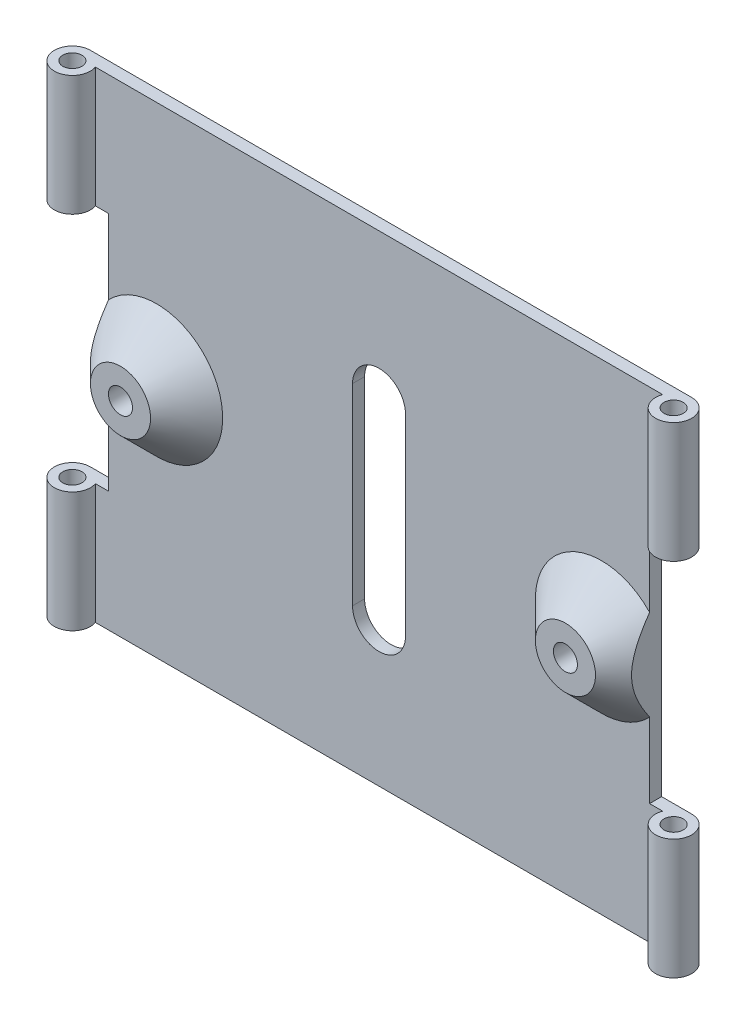
ISO-10303-21;
HEADER;
FILE_DESCRIPTION(('STEP AP214'),'2;1');
FILE_NAME('part.step','',(''),(''),'','','');
FILE_SCHEMA(('AUTOMOTIVE_DESIGN { 1 0 10303 214 1 1 1 1 }'));
ENDSEC;
DATA;
#1=APPLICATION_CONTEXT('core data for automotive mechanical design processes');
#2=APPLICATION_PROTOCOL_DEFINITION('international standard','automotive_design',2000,#1);
#3=PRODUCT_CONTEXT('',#1,'mechanical');
#4=PRODUCT('Part','Part','',(#3));
#5=PRODUCT_RELATED_PRODUCT_CATEGORY('part','',(#4));
#6=PRODUCT_DEFINITION_FORMATION('','',#4);
#7=PRODUCT_DEFINITION_CONTEXT('part definition',#1,'design');
#8=PRODUCT_DEFINITION('design','',#6,#7);
#9=PRODUCT_DEFINITION_SHAPE('','',#8);
#10=(LENGTH_UNIT() NAMED_UNIT(*) SI_UNIT(.MILLI.,.METRE.));
#11=(NAMED_UNIT(*) PLANE_ANGLE_UNIT() SI_UNIT($,.RADIAN.));
#12=(NAMED_UNIT(*) SI_UNIT($,.STERADIAN.) SOLID_ANGLE_UNIT());
#13=UNCERTAINTY_MEASURE_WITH_UNIT(LENGTH_MEASURE(1.E-05),#10,'distance_accuracy_value','');
#14=(GEOMETRIC_REPRESENTATION_CONTEXT(3) GLOBAL_UNCERTAINTY_ASSIGNED_CONTEXT((#13)) GLOBAL_UNIT_ASSIGNED_CONTEXT((#10,
#11,#12)) REPRESENTATION_CONTEXT('',''));
#15=CARTESIAN_POINT('',(0.,0.,0.));
#16=DIRECTION('',(0.,0.,1.));
#17=DIRECTION('',(1.,0.,0.));
#18=AXIS2_PLACEMENT_3D('',#15,#16,#17);
#19=CARTESIAN_POINT('',(25.,-24.2426406871193,1.5));
#20=DIRECTION('',(0.,1.,0.));
#21=DIRECTION('',(0.,0.,1.));
#22=AXIS2_PLACEMENT_3D('',#19,#20,#21);
#23=CYLINDRICAL_SURFACE('',#22,1.5);
#24=DIRECTION('',(0.,1.,0.));
#25=VECTOR('',#24,1.);
#26=CARTESIAN_POINT('',(23.5857864376269,-24.2426406871193,1.));
#27=LINE('',#26,#25);
#28=CARTESIAN_POINT('',(23.5857864376269,10.,1.));
#29=VERTEX_POINT('',#28);
#30=CARTESIAN_POINT('',(23.5857864376269,20.,1.));
#31=VERTEX_POINT('',#30);
#32=EDGE_CURVE('E254',#29,#31,#27,.T.);
#33=ORIENTED_EDGE('',*,*,#32,.F.);
#34=CARTESIAN_POINT('',(25.,10.,1.5));
#35=DIRECTION('',(0.,1.,0.));
#36=DIRECTION('',(0.,0.,1.));
#37=AXIS2_PLACEMENT_3D('',#34,#35,#36);
#38=CIRCLE('',#37,1.5);
#39=CARTESIAN_POINT('',(25.,10.,0.));
#40=VERTEX_POINT('',#39);
#41=EDGE_CURVE('E199',#40,#29,#38,.F.);
#42=ORIENTED_EDGE('',*,*,#41,.F.);
#43=DIRECTION('',(0.,1.,0.));
#44=VECTOR('',#43,1.);
#45=CARTESIAN_POINT('',(25.,-20.,0.));
#46=LINE('',#45,#44);
#47=CARTESIAN_POINT('',(25.,20.,0.));
#48=VERTEX_POINT('',#47);
#49=EDGE_CURVE('E299',#40,#48,#46,.T.);
#50=ORIENTED_EDGE('',*,*,#49,.T.);
#51=CARTESIAN_POINT('',(25.,20.,1.5));
#52=DIRECTION('',(0.,1.,0.));
#53=DIRECTION('',(0.,0.,1.));
#54=AXIS2_PLACEMENT_3D('',#51,#52,#53);
#55=CIRCLE('',#54,1.5);
#56=EDGE_CURVE('E246',#31,#48,#55,.T.);
#57=ORIENTED_EDGE('',*,*,#56,.F.);
#58=EDGE_LOOP('',(#33,#42,#50,#57));
#59=FACE_BOUND('',#58,.T.);
#60=ADVANCED_FACE('F33',(#59),#23,.T.);
#61=CARTESIAN_POINT('',(25.,-20.,1.5));
#62=DIRECTION('',(0.,1.,0.));
#63=DIRECTION('',(0.,0.,1.));
#64=AXIS2_PLACEMENT_3D('',#61,#62,#63);
#65=CYLINDRICAL_SURFACE('',#64,0.799999999999999);
#66=CARTESIAN_POINT('',(25.,10.,1.5));
#67=DIRECTION('',(0.,1.,0.));
#68=DIRECTION('',(0.,0.,1.));
#69=AXIS2_PLACEMENT_3D('',#66,#67,#68);
#70=CIRCLE('',#69,0.799999999999999);
#71=CARTESIAN_POINT('',(25.,10.,2.3));
#72=VERTEX_POINT('',#71);
#73=EDGE_CURVE('E198',#72,#72,#70,.F.);
#74=ORIENTED_EDGE('',*,*,#73,.T.);
#75=EDGE_LOOP('',(#74));
#76=FACE_BOUND('',#75,.T.);
#77=CARTESIAN_POINT('',(25.,20.,1.5));
#78=DIRECTION('',(0.,1.,0.));
#79=DIRECTION('',(0.,0.,1.));
#80=AXIS2_PLACEMENT_3D('',#77,#78,#79);
#81=CIRCLE('',#80,0.799999999999999);
#82=CARTESIAN_POINT('',(25.,20.,2.3));
#83=VERTEX_POINT('',#82);
#84=EDGE_CURVE('E236',#83,#83,#81,.T.);
#85=ORIENTED_EDGE('',*,*,#84,.T.);
#86=EDGE_LOOP('',(#85));
#87=FACE_BOUND('',#86,.T.);
#88=ADVANCED_FACE('F390',(#76,#87),#65,.F.);
#89=CARTESIAN_POINT('',(-25.,-24.2426406871193,1.5));
#90=DIRECTION('',(0.,1.,0.));
#91=DIRECTION('',(0.,0.,1.));
#92=AXIS2_PLACEMENT_3D('',#89,#90,#91);
#93=CYLINDRICAL_SURFACE('',#92,1.5);
#94=CARTESIAN_POINT('',(-25.,9.99999999999999,1.5));
#95=DIRECTION('',(0.,1.,0.));
#96=DIRECTION('',(-1.,0.,0.));
#97=AXIS2_PLACEMENT_3D('',#94,#95,#96);
#98=CIRCLE('',#97,1.5);
#99=CARTESIAN_POINT('',(-23.5857864376269,9.99999999999999,1.));
#100=VERTEX_POINT('',#99);
#101=CARTESIAN_POINT('',(-25.,10.,0.));
#102=VERTEX_POINT('',#101);
#103=EDGE_CURVE('E222',#100,#102,#98,.F.);
#104=ORIENTED_EDGE('',*,*,#103,.F.);
#105=DIRECTION('',(0.,1.,0.));
#106=VECTOR('',#105,1.);
#107=CARTESIAN_POINT('',(-23.5857864376269,-24.2426406871193,1.));
#108=LINE('',#107,#106);
#109=CARTESIAN_POINT('',(-23.5857864376269,20.,1.));
#110=VERTEX_POINT('',#109);
#111=EDGE_CURVE('E265',#110,#100,#108,.F.);
#112=ORIENTED_EDGE('',*,*,#111,.F.);
#113=CARTESIAN_POINT('',(-25.,20.,1.5));
#114=DIRECTION('',(0.,1.,0.));
#115=DIRECTION('',(0.,0.,1.));
#116=AXIS2_PLACEMENT_3D('',#113,#114,#115);
#117=CIRCLE('',#116,1.5);
#118=CARTESIAN_POINT('',(-25.,20.,0.));
#119=VERTEX_POINT('',#118);
#120=EDGE_CURVE('E258',#119,#110,#117,.T.);
#121=ORIENTED_EDGE('',*,*,#120,.F.);
#122=DIRECTION('',(0.,-1.,0.));
#123=VECTOR('',#122,1.);
#124=CARTESIAN_POINT('',(-25.,-20.,0.));
#125=LINE('',#124,#123);
#126=EDGE_CURVE('E312',#119,#102,#125,.T.);
#127=ORIENTED_EDGE('',*,*,#126,.T.);
#128=EDGE_LOOP('',(#104,#112,#121,#127));
#129=FACE_BOUND('',#128,.T.);
#130=ADVANCED_FACE('F378',(#129),#93,.T.);
#131=CARTESIAN_POINT('',(-25.,-20.,1.5));
#132=DIRECTION('',(0.,1.,0.));
#133=DIRECTION('',(0.,0.,1.));
#134=AXIS2_PLACEMENT_3D('',#131,#132,#133);
#135=CYLINDRICAL_SURFACE('',#134,0.799999999999999);
#136=CARTESIAN_POINT('',(-25.,-10.,1.5));
#137=DIRECTION('',(0.,-1.,0.));
#138=DIRECTION('',(1.,0.,0.));
#139=AXIS2_PLACEMENT_3D('',#136,#137,#138);
#140=CIRCLE('',#139,0.799999999999999);
#141=CARTESIAN_POINT('',(-24.2,-10.,1.5));
#142=VERTEX_POINT('',#141);
#143=EDGE_CURVE('E227',#142,#142,#140,.F.);
#144=ORIENTED_EDGE('',*,*,#143,.T.);
#145=EDGE_LOOP('',(#144));
#146=FACE_BOUND('',#145,.T.);
#147=CARTESIAN_POINT('',(-25.,-20.,1.5));
#148=DIRECTION('',(0.,1.,0.));
#149=DIRECTION('',(0.,0.,1.));
#150=AXIS2_PLACEMENT_3D('',#147,#148,#149);
#151=CIRCLE('',#150,0.799999999999999);
#152=CARTESIAN_POINT('',(-25.,-20.,2.3));
#153=VERTEX_POINT('',#152);
#154=EDGE_CURVE('E243',#153,#153,#151,.T.);
#155=ORIENTED_EDGE('',*,*,#154,.F.);
#156=EDGE_LOOP('',(#155));
#157=FACE_BOUND('',#156,.T.);
#158=ADVANCED_FACE('F355',(#146,#157),#135,.F.);
#159=CARTESIAN_POINT('',(0.,0.,1.));
#160=DIRECTION('',(0.,0.,-1.));
#161=DIRECTION('',(-1.,0.,0.));
#162=AXIS2_PLACEMENT_3D('',#159,#160,#161);
#163=PLANE('',#162);
#164=DIRECTION('',(0.,1.,0.));
#165=VECTOR('',#164,1.);
#166=CARTESIAN_POINT('',(22.5,0.,1.));
#167=LINE('',#166,#165);
#168=CARTESIAN_POINT('',(22.5,-10.,1.));
#169=VERTEX_POINT('',#168);
#170=CARTESIAN_POINT('',(22.5,-3.77491721763541,1.));
#171=VERTEX_POINT('',#170);
#172=EDGE_CURVE('E168',#169,#171,#167,.T.);
#173=ORIENTED_EDGE('',*,*,#172,.T.);
#174=CARTESIAN_POINT('',(18.5,0.,1.));
#175=DIRECTION('',(0.,0.,-1.));
#176=DIRECTION('',(-1.,0.,0.));
#177=AXIS2_PLACEMENT_3D('',#174,#175,#176);
#178=CIRCLE('',#177,5.50000000000002);
#179=CARTESIAN_POINT('',(22.5,3.77491721763541,1.));
#180=VERTEX_POINT('',#179);
#181=EDGE_CURVE('E326',#171,#180,#178,.T.);
#182=ORIENTED_EDGE('',*,*,#181,.T.);
#183=CARTESIAN_POINT('',(22.5,10.,1.));
#184=VERTEX_POINT('',#183);
#185=EDGE_CURVE('E204',#180,#184,#167,.T.);
#186=ORIENTED_EDGE('',*,*,#185,.T.);
#187=DIRECTION('',(1.,0.,0.));
#188=VECTOR('',#187,1.);
#189=CARTESIAN_POINT('',(0.,10.,1.));
#190=LINE('',#189,#188);
#191=EDGE_CURVE('E201',#184,#29,#190,.T.);
#192=ORIENTED_EDGE('',*,*,#191,.T.);
#193=ORIENTED_EDGE('',*,*,#32,.T.);
#194=DIRECTION('',(-1.,0.,0.));
#195=VECTOR('',#194,1.);
#196=CARTESIAN_POINT('',(-25.,20.,1.));
#197=LINE('',#196,#195);
#198=EDGE_CURVE('E300',#31,#110,#197,.T.);
#199=ORIENTED_EDGE('',*,*,#198,.T.);
#200=ORIENTED_EDGE('',*,*,#111,.T.);
#201=DIRECTION('',(1.,0.,0.));
#202=VECTOR('',#201,1.);
#203=CARTESIAN_POINT('',(0.,10.,1.));
#204=LINE('',#203,#202);
#205=CARTESIAN_POINT('',(-22.5,10.,1.));
#206=VERTEX_POINT('',#205);
#207=EDGE_CURVE('E224',#100,#206,#204,.T.);
#208=ORIENTED_EDGE('',*,*,#207,.T.);
#209=DIRECTION('',(0.,-1.,0.));
#210=VECTOR('',#209,1.);
#211=CARTESIAN_POINT('',(-22.5,0.,1.));
#212=LINE('',#211,#210);
#213=CARTESIAN_POINT('',(-22.5,3.77491721763535,1.));
#214=VERTEX_POINT('',#213);
#215=EDGE_CURVE('E234',#206,#214,#212,.T.);
#216=ORIENTED_EDGE('',*,*,#215,.T.);
#217=CARTESIAN_POINT('',(-18.5,0.,1.));
#218=DIRECTION('',(0.,0.,-1.));
#219=DIRECTION('',(-1.,0.,0.));
#220=AXIS2_PLACEMENT_3D('',#217,#218,#219);
#221=CIRCLE('',#220,5.49999999999999);
#222=CARTESIAN_POINT('',(-22.5,-3.77491721763535,1.));
#223=VERTEX_POINT('',#222);
#224=EDGE_CURVE('E305',#214,#223,#221,.T.);
#225=ORIENTED_EDGE('',*,*,#224,.T.);
#226=CARTESIAN_POINT('',(-22.5,-10.,1.));
#227=VERTEX_POINT('',#226);
#228=EDGE_CURVE('E233',#223,#227,#212,.T.);
#229=ORIENTED_EDGE('',*,*,#228,.T.);
#230=DIRECTION('',(-1.,0.,0.));
#231=VECTOR('',#230,1.);
#232=CARTESIAN_POINT('',(0.,-10.,1.));
#233=LINE('',#232,#231);
#234=CARTESIAN_POINT('',(-23.5857864376269,-10.,1.));
#235=VERTEX_POINT('',#234);
#236=EDGE_CURVE('E230',#227,#235,#233,.T.);
#237=ORIENTED_EDGE('',*,*,#236,.T.);
#238=CARTESIAN_POINT('',(-23.5857864376269,-20.,1.));
#239=VERTEX_POINT('',#238);
#240=EDGE_CURVE('E264',#235,#239,#108,.F.);
#241=ORIENTED_EDGE('',*,*,#240,.T.);
#242=DIRECTION('',(1.,0.,0.));
#243=VECTOR('',#242,1.);
#244=CARTESIAN_POINT('',(-25.,-20.,1.));
#245=LINE('',#244,#243);
#246=CARTESIAN_POINT('',(23.5857864376269,-20.,1.));
#247=VERTEX_POINT('',#246);
#248=EDGE_CURVE('E302',#239,#247,#245,.T.);
#249=ORIENTED_EDGE('',*,*,#248,.T.);
#250=CARTESIAN_POINT('',(23.5857864376269,-10.,1.));
#251=VERTEX_POINT('',#250);
#252=EDGE_CURVE('E255',#247,#251,#27,.T.);
#253=ORIENTED_EDGE('',*,*,#252,.T.);
#254=DIRECTION('',(-1.,0.,0.));
#255=VECTOR('',#254,1.);
#256=CARTESIAN_POINT('',(0.,-10.,1.));
#257=LINE('',#256,#255);
#258=EDGE_CURVE('E196',#251,#169,#257,.T.);
#259=ORIENTED_EDGE('',*,*,#258,.T.);
#260=EDGE_LOOP('',(#173,#182,#186,#192,#193,#199,#200,#208,#216,#225,#229,#237,#241,#249,#253,#259));
#261=FACE_BOUND('',#260,.T.);
#262=CARTESIAN_POINT('',(0.,7.8985132931506,1.));
#263=DIRECTION('',(0.,0.,1.));
#264=DIRECTION('',(1.,0.,0.));
#265=AXIS2_PLACEMENT_3D('',#262,#263,#264);
#266=CIRCLE('',#265,2.2);
#267=CARTESIAN_POINT('',(2.19999999999999,7.89851329315059,1.));
#268=VERTEX_POINT('',#267);
#269=CARTESIAN_POINT('',(-2.20000000000001,7.89851329315059,1.));
#270=VERTEX_POINT('',#269);
#271=EDGE_CURVE('E269',#268,#270,#266,.T.);
#272=ORIENTED_EDGE('',*,*,#271,.F.);
#273=DIRECTION('',(0.,1.,0.));
#274=VECTOR('',#273,1.);
#275=CARTESIAN_POINT('',(2.19999999999999,7.89851329315059,1.));
#276=LINE('',#275,#274);
#277=CARTESIAN_POINT('',(2.19999999999999,-8.10148670684941,1.));
#278=VERTEX_POINT('',#277);
#279=EDGE_CURVE('E277',#278,#268,#276,.T.);
#280=ORIENTED_EDGE('',*,*,#279,.F.);
#281=CARTESIAN_POINT('',(0.,-8.1014867068494,1.));
#282=DIRECTION('',(0.,0.,1.));
#283=DIRECTION('',(1.,0.,0.));
#284=AXIS2_PLACEMENT_3D('',#281,#282,#283);
#285=CIRCLE('',#284,2.2);
#286=CARTESIAN_POINT('',(-2.2,-8.1014867068494,1.));
#287=VERTEX_POINT('',#286);
#288=EDGE_CURVE('E274',#287,#278,#285,.T.);
#289=ORIENTED_EDGE('',*,*,#288,.F.);
#290=DIRECTION('',(0.,-1.,0.));
#291=VECTOR('',#290,1.);
#292=CARTESIAN_POINT('',(-2.20000000000001,7.89851329315059,1.));
#293=LINE('',#292,#291);
#294=EDGE_CURVE('E271',#270,#287,#293,.T.);
#295=ORIENTED_EDGE('',*,*,#294,.F.);
#296=EDGE_LOOP('',(#272,#280,#289,#295));
#297=FACE_BOUND('',#296,.T.);
#298=ADVANCED_FACE('F352',(#261,#297),#163,.F.);
#299=CARTESIAN_POINT('',(0.,0.,0.));
#300=DIRECTION('',(0.,0.,-1.));
#301=DIRECTION('',(-1.,0.,0.));
#302=AXIS2_PLACEMENT_3D('',#299,#300,#301);
#303=PLANE('',#302);
#304=DIRECTION('',(-1.,0.,0.));
#305=VECTOR('',#304,1.);
#306=CARTESIAN_POINT('',(22.5,10.,0.));
#307=LINE('',#306,#305);
#308=CARTESIAN_POINT('',(22.5,10.,0.));
#309=VERTEX_POINT('',#308);
#310=EDGE_CURVE('E173',#40,#309,#307,.T.);
#311=ORIENTED_EDGE('',*,*,#310,.T.);
#312=DIRECTION('',(0.,-1.,0.));
#313=VECTOR('',#312,1.);
#314=CARTESIAN_POINT('',(22.5,10.,0.));
#315=LINE('',#314,#313);
#316=CARTESIAN_POINT('',(22.5,-10.,0.));
#317=VERTEX_POINT('',#316);
#318=EDGE_CURVE('E165',#309,#317,#315,.T.);
#319=ORIENTED_EDGE('',*,*,#318,.T.);
#320=DIRECTION('',(1.,0.,0.));
#321=VECTOR('',#320,1.);
#322=CARTESIAN_POINT('',(22.5,-10.,0.));
#323=LINE('',#322,#321);
#324=CARTESIAN_POINT('',(25.,-10.,0.));
#325=VERTEX_POINT('',#324);
#326=EDGE_CURVE('E176',#317,#325,#323,.T.);
#327=ORIENTED_EDGE('',*,*,#326,.T.);
#328=CARTESIAN_POINT('',(25.,-20.,0.));
#329=VERTEX_POINT('',#328);
#330=EDGE_CURVE('E306',#329,#325,#46,.T.);
#331=ORIENTED_EDGE('',*,*,#330,.F.);
#332=DIRECTION('',(1.,0.,0.));
#333=VECTOR('',#332,1.);
#334=CARTESIAN_POINT('',(-25.,-20.,0.));
#335=LINE('',#334,#333);
#336=CARTESIAN_POINT('',(-25.,-20.,0.));
#337=VERTEX_POINT('',#336);
#338=EDGE_CURVE('E303',#337,#329,#335,.T.);
#339=ORIENTED_EDGE('',*,*,#338,.F.);
#340=CARTESIAN_POINT('',(-25.,-10.,0.));
#341=VERTEX_POINT('',#340);
#342=EDGE_CURVE('E311',#341,#337,#125,.T.);
#343=ORIENTED_EDGE('',*,*,#342,.F.);
#344=DIRECTION('',(1.,0.,0.));
#345=VECTOR('',#344,1.);
#346=CARTESIAN_POINT('',(-22.5,-10.,0.));
#347=LINE('',#346,#345);
#348=CARTESIAN_POINT('',(-22.5,-10.,0.));
#349=VERTEX_POINT('',#348);
#350=EDGE_CURVE('E212',#341,#349,#347,.T.);
#351=ORIENTED_EDGE('',*,*,#350,.T.);
#352=DIRECTION('',(0.,1.,0.));
#353=VECTOR('',#352,1.);
#354=CARTESIAN_POINT('',(-22.5,10.,0.));
#355=LINE('',#354,#353);
#356=CARTESIAN_POINT('',(-22.5,10.,0.));
#357=VERTEX_POINT('',#356);
#358=EDGE_CURVE('E206',#349,#357,#355,.T.);
#359=ORIENTED_EDGE('',*,*,#358,.T.);
#360=DIRECTION('',(-1.,0.,0.));
#361=VECTOR('',#360,1.);
#362=CARTESIAN_POINT('',(-22.5,10.,0.));
#363=LINE('',#362,#361);
#364=EDGE_CURVE('E209',#357,#102,#363,.T.);
#365=ORIENTED_EDGE('',*,*,#364,.T.);
#366=ORIENTED_EDGE('',*,*,#126,.F.);
#367=DIRECTION('',(-1.,0.,0.));
#368=VECTOR('',#367,1.);
#369=CARTESIAN_POINT('',(-25.,20.,0.));
#370=LINE('',#369,#368);
#371=EDGE_CURVE('E308',#48,#119,#370,.T.);
#372=ORIENTED_EDGE('',*,*,#371,.F.);
#373=ORIENTED_EDGE('',*,*,#49,.F.);
#374=EDGE_LOOP('',(#311,#319,#327,#331,#339,#343,#351,#359,#365,#366,#372,#373));
#375=FACE_BOUND('',#374,.T.);
#376=DIRECTION('',(0.,1.,0.));
#377=VECTOR('',#376,1.);
#378=CARTESIAN_POINT('',(2.19999999999999,7.89851329315059,0.));
#379=LINE('',#378,#377);
#380=CARTESIAN_POINT('',(2.19999999999999,-8.10148670684941,0.));
#381=VERTEX_POINT('',#380);
#382=CARTESIAN_POINT('',(2.19999999999999,7.89851329315059,0.));
#383=VERTEX_POINT('',#382);
#384=EDGE_CURVE('E272',#381,#383,#379,.T.);
#385=ORIENTED_EDGE('',*,*,#384,.T.);
#386=CARTESIAN_POINT('',(0.,7.8985132931506,0.));
#387=DIRECTION('',(0.,0.,1.));
#388=DIRECTION('',(1.,0.,0.));
#389=AXIS2_PLACEMENT_3D('',#386,#387,#388);
#390=CIRCLE('',#389,2.2);
#391=CARTESIAN_POINT('',(-2.20000000000001,7.89851329315059,0.));
#392=VERTEX_POINT('',#391);
#393=EDGE_CURVE('E268',#383,#392,#390,.T.);
#394=ORIENTED_EDGE('',*,*,#393,.T.);
#395=DIRECTION('',(0.,-1.,0.));
#396=VECTOR('',#395,1.);
#397=CARTESIAN_POINT('',(-2.20000000000001,7.89851329315059,0.));
#398=LINE('',#397,#396);
#399=CARTESIAN_POINT('',(-2.2,-8.1014867068494,0.));
#400=VERTEX_POINT('',#399);
#401=EDGE_CURVE('E282',#392,#400,#398,.T.);
#402=ORIENTED_EDGE('',*,*,#401,.T.);
#403=CARTESIAN_POINT('',(0.,-8.1014867068494,0.));
#404=DIRECTION('',(0.,0.,1.));
#405=DIRECTION('',(1.,0.,0.));
#406=AXIS2_PLACEMENT_3D('',#403,#404,#405);
#407=CIRCLE('',#406,2.2);
#408=EDGE_CURVE('E285',#400,#381,#407,.T.);
#409=ORIENTED_EDGE('',*,*,#408,.T.);
#410=EDGE_LOOP('',(#385,#394,#402,#409));
#411=FACE_BOUND('',#410,.T.);
#412=ADVANCED_FACE('F182',(#375,#411),#303,.T.);
#413=CARTESIAN_POINT('',(-25.,20.,1.));
#414=DIRECTION('',(0.,-1.,0.));
#415=DIRECTION('',(0.,0.,-1.));
#416=AXIS2_PLACEMENT_3D('',#413,#414,#415);
#417=PLANE('',#416);
#418=ORIENTED_EDGE('',*,*,#84,.F.);
#419=EDGE_LOOP('',(#418));
#420=FACE_BOUND('',#419,.T.);
#421=CARTESIAN_POINT('',(-25.,20.,1.5));
#422=DIRECTION('',(0.,1.,0.));
#423=DIRECTION('',(0.,0.,1.));
#424=AXIS2_PLACEMENT_3D('',#421,#422,#423);
#425=CIRCLE('',#424,0.799999999999999);
#426=CARTESIAN_POINT('',(-25.,20.,2.3));
#427=VERTEX_POINT('',#426);
#428=EDGE_CURVE('E240',#427,#427,#425,.T.);
#429=ORIENTED_EDGE('',*,*,#428,.F.);
#430=EDGE_LOOP('',(#429));
#431=FACE_BOUND('',#430,.T.);
#432=ORIENTED_EDGE('',*,*,#198,.F.);
#433=ORIENTED_EDGE('',*,*,#56,.T.);
#434=ORIENTED_EDGE('',*,*,#371,.T.);
#435=ORIENTED_EDGE('',*,*,#120,.T.);
#436=EDGE_LOOP('',(#432,#433,#434,#435));
#437=FACE_BOUND('',#436,.T.);
#438=ADVANCED_FACE('F341',(#420,#431,#437),#417,.F.);
#439=CARTESIAN_POINT('',(-25.,-20.,1.));
#440=DIRECTION('',(0.,1.,0.));
#441=DIRECTION('',(0.,0.,1.));
#442=AXIS2_PLACEMENT_3D('',#439,#440,#441);
#443=PLANE('',#442);
#444=CARTESIAN_POINT('',(25.,-20.,1.5));
#445=DIRECTION('',(0.,1.,0.));
#446=DIRECTION('',(0.,0.,1.));
#447=AXIS2_PLACEMENT_3D('',#444,#445,#446);
#448=CIRCLE('',#447,0.799999999999999);
#449=CARTESIAN_POINT('',(25.,-20.,2.3));
#450=VERTEX_POINT('',#449);
#451=EDGE_CURVE('E237',#450,#450,#448,.T.);
#452=ORIENTED_EDGE('',*,*,#451,.T.);
#453=EDGE_LOOP('',(#452));
#454=FACE_BOUND('',#453,.T.);
#455=ORIENTED_EDGE('',*,*,#154,.T.);
#456=EDGE_LOOP('',(#455));
#457=FACE_BOUND('',#456,.T.);
#458=ORIENTED_EDGE('',*,*,#338,.T.);
#459=CARTESIAN_POINT('',(25.,-20.,1.5));
#460=DIRECTION('',(0.,1.,0.));
#461=DIRECTION('',(0.,0.,1.));
#462=AXIS2_PLACEMENT_3D('',#459,#460,#461);
#463=CIRCLE('',#462,1.5);
#464=EDGE_CURVE('E251',#329,#247,#463,.F.);
#465=ORIENTED_EDGE('',*,*,#464,.T.);
#466=ORIENTED_EDGE('',*,*,#248,.F.);
#467=CARTESIAN_POINT('',(-25.,-20.,1.5));
#468=DIRECTION('',(0.,1.,0.));
#469=DIRECTION('',(0.,0.,1.));
#470=AXIS2_PLACEMENT_3D('',#467,#468,#469);
#471=CIRCLE('',#470,1.5);
#472=EDGE_CURVE('E261',#239,#337,#471,.F.);
#473=ORIENTED_EDGE('',*,*,#472,.T.);
#474=EDGE_LOOP('',(#458,#465,#466,#473));
#475=FACE_BOUND('',#474,.T.);
#476=ADVANCED_FACE('F344',(#454,#457,#475),#443,.F.);
#477=CARTESIAN_POINT('',(0.,7.8985132931506,1.));
#478=DIRECTION('',(0.,0.,-1.));
#479=DIRECTION('',(-1.,0.,0.));
#480=AXIS2_PLACEMENT_3D('',#477,#478,#479);
#481=CYLINDRICAL_SURFACE('',#480,2.2);
#482=ORIENTED_EDGE('',*,*,#393,.F.);
#483=DIRECTION('',(0.,0.,-1.));
#484=VECTOR('',#483,1.);
#485=CARTESIAN_POINT('',(2.19999999999999,7.89851329315059,1.));
#486=LINE('',#485,#484);
#487=EDGE_CURVE('E279',#268,#383,#486,.T.);
#488=ORIENTED_EDGE('',*,*,#487,.F.);
#489=ORIENTED_EDGE('',*,*,#271,.T.);
#490=DIRECTION('',(0.,0.,-1.));
#491=VECTOR('',#490,1.);
#492=CARTESIAN_POINT('',(-2.20000000000001,7.89851329315059,1.));
#493=LINE('',#492,#491);
#494=EDGE_CURVE('E296',#270,#392,#493,.T.);
#495=ORIENTED_EDGE('',*,*,#494,.T.);
#496=EDGE_LOOP('',(#482,#488,#489,#495));
#497=FACE_BOUND('',#496,.T.);
#498=ADVANCED_FACE('F348',(#497),#481,.F.);
#499=CARTESIAN_POINT('',(-2.20000000000001,7.89851329315059,1.));
#500=DIRECTION('',(1.,0.,0.));
#501=DIRECTION('',(0.,1.,0.));
#502=AXIS2_PLACEMENT_3D('',#499,#500,#501);
#503=PLANE('',#502);
#504=ORIENTED_EDGE('',*,*,#401,.F.);
#505=ORIENTED_EDGE('',*,*,#494,.F.);
#506=ORIENTED_EDGE('',*,*,#294,.T.);
#507=DIRECTION('',(0.,0.,-1.));
#508=VECTOR('',#507,1.);
#509=CARTESIAN_POINT('',(-2.2,-8.1014867068494,1.));
#510=LINE('',#509,#508);
#511=EDGE_CURVE('E294',#287,#400,#510,.T.);
#512=ORIENTED_EDGE('',*,*,#511,.T.);
#513=EDGE_LOOP('',(#504,#505,#506,#512));
#514=FACE_BOUND('',#513,.T.);
#515=ADVANCED_FACE('F360',(#514),#503,.T.);
#516=CARTESIAN_POINT('',(0.,-8.1014867068494,1.));
#517=DIRECTION('',(0.,0.,-1.));
#518=DIRECTION('',(-1.,0.,0.));
#519=AXIS2_PLACEMENT_3D('',#516,#517,#518);
#520=CYLINDRICAL_SURFACE('',#519,2.2);
#521=ORIENTED_EDGE('',*,*,#408,.F.);
#522=ORIENTED_EDGE('',*,*,#511,.F.);
#523=ORIENTED_EDGE('',*,*,#288,.T.);
#524=DIRECTION('',(0.,0.,-1.));
#525=VECTOR('',#524,1.);
#526=CARTESIAN_POINT('',(2.19999999999999,-8.10148670684941,1.));
#527=LINE('',#526,#525);
#528=EDGE_CURVE('E292',#278,#381,#527,.T.);
#529=ORIENTED_EDGE('',*,*,#528,.T.);
#530=EDGE_LOOP('',(#521,#522,#523,#529));
#531=FACE_BOUND('',#530,.T.);
#532=ADVANCED_FACE('F364',(#531),#520,.F.);
#533=CARTESIAN_POINT('',(2.19999999999999,7.89851329315059,1.));
#534=DIRECTION('',(-1.,0.,0.));
#535=DIRECTION('',(0.,-1.,0.));
#536=AXIS2_PLACEMENT_3D('',#533,#534,#535);
#537=PLANE('',#536);
#538=ORIENTED_EDGE('',*,*,#384,.F.);
#539=ORIENTED_EDGE('',*,*,#528,.F.);
#540=ORIENTED_EDGE('',*,*,#279,.T.);
#541=ORIENTED_EDGE('',*,*,#487,.T.);
#542=EDGE_LOOP('',(#538,#539,#540,#541));
#543=FACE_BOUND('',#542,.T.);
#544=ADVANCED_FACE('F368',(#543),#537,.T.);
#545=CARTESIAN_POINT('',(-25.,-10.,1.5));
#546=DIRECTION('',(0.,-1.,0.));
#547=DIRECTION('',(1.,0.,0.));
#548=AXIS2_PLACEMENT_3D('',#545,#546,#547);
#549=CIRCLE('',#548,1.5);
#550=EDGE_CURVE('E228',#341,#235,#549,.F.);
#551=ORIENTED_EDGE('',*,*,#550,.F.);
#552=ORIENTED_EDGE('',*,*,#342,.T.);
#553=ORIENTED_EDGE('',*,*,#472,.F.);
#554=ORIENTED_EDGE('',*,*,#240,.F.);
#555=EDGE_LOOP('',(#551,#552,#553,#554));
#556=FACE_BOUND('',#555,.T.);
#557=ADVANCED_FACE('F372',(#556),#93,.T.);
#558=CARTESIAN_POINT('',(25.,-10.,1.5));
#559=DIRECTION('',(0.,-1.,0.));
#560=DIRECTION('',(0.,0.,-1.));
#561=AXIS2_PLACEMENT_3D('',#558,#559,#560);
#562=CIRCLE('',#561,1.5);
#563=EDGE_CURVE('E178',#251,#325,#562,.F.);
#564=ORIENTED_EDGE('',*,*,#563,.F.);
#565=ORIENTED_EDGE('',*,*,#252,.F.);
#566=ORIENTED_EDGE('',*,*,#464,.F.);
#567=ORIENTED_EDGE('',*,*,#330,.T.);
#568=EDGE_LOOP('',(#564,#565,#566,#567));
#569=FACE_BOUND('',#568,.T.);
#570=ADVANCED_FACE('F376',(#569),#23,.T.);
#571=CARTESIAN_POINT('',(-25.,9.99999999999999,1.5));
#572=DIRECTION('',(0.,1.,0.));
#573=DIRECTION('',(-1.,0.,0.));
#574=AXIS2_PLACEMENT_3D('',#571,#572,#573);
#575=CIRCLE('',#574,0.799999999999999);
#576=CARTESIAN_POINT('',(-25.8,9.99999999999999,1.5));
#577=VERTEX_POINT('',#576);
#578=EDGE_CURVE('E219',#577,#577,#575,.F.);
#579=ORIENTED_EDGE('',*,*,#578,.T.);
#580=EDGE_LOOP('',(#579));
#581=FACE_BOUND('',#580,.T.);
#582=ORIENTED_EDGE('',*,*,#428,.T.);
#583=EDGE_LOOP('',(#582));
#584=FACE_BOUND('',#583,.T.);
#585=ADVANCED_FACE('F381',(#581,#584),#135,.F.);
#586=CARTESIAN_POINT('',(25.,-10.,1.5));
#587=DIRECTION('',(0.,-1.,0.));
#588=DIRECTION('',(0.,0.,-1.));
#589=AXIS2_PLACEMENT_3D('',#586,#587,#588);
#590=CIRCLE('',#589,0.799999999999999);
#591=CARTESIAN_POINT('',(25.,-10.,0.700000000000001));
#592=VERTEX_POINT('',#591);
#593=EDGE_CURVE('E193',#592,#592,#590,.F.);
#594=ORIENTED_EDGE('',*,*,#593,.T.);
#595=EDGE_LOOP('',(#594));
#596=FACE_BOUND('',#595,.T.);
#597=ORIENTED_EDGE('',*,*,#451,.F.);
#598=EDGE_LOOP('',(#597));
#599=FACE_BOUND('',#598,.T.);
#600=ADVANCED_FACE('F385',(#596,#599),#65,.F.);
#601=CARTESIAN_POINT('',(-22.5,10.,0.));
#602=DIRECTION('',(1.,0.,0.));
#603=DIRECTION('',(0.,0.,-1.));
#604=AXIS2_PLACEMENT_3D('',#601,#602,#603);
#605=PLANE('',#604);
#606=DIRECTION('',(0.,0.,1.));
#607=VECTOR('',#606,1.);
#608=CARTESIAN_POINT('',(-22.5,10.,0.));
#609=LINE('',#608,#607);
#610=EDGE_CURVE('E215',#357,#206,#609,.T.);
#611=ORIENTED_EDGE('',*,*,#610,.F.);
#612=ORIENTED_EDGE('',*,*,#358,.F.);
#613=DIRECTION('',(0.,0.,1.));
#614=VECTOR('',#613,1.);
#615=CARTESIAN_POINT('',(-22.5,-10.,0.));
#616=LINE('',#615,#614);
#617=EDGE_CURVE('E216',#349,#227,#616,.T.);
#618=ORIENTED_EDGE('',*,*,#617,.T.);
#619=ORIENTED_EDGE('',*,*,#228,.F.);
#620=CARTESIAN_POINT('',(-22.5,-3.77491721763535,1.));
#621=CARTESIAN_POINT('',(-22.5,-3.66427627532521,1.0759112562645));
#622=CARTESIAN_POINT('',(-22.5,-3.55282182116742,1.15066732249182));
#623=CARTESIAN_POINT('',(-22.5,-3.3279596058378,1.29731140496872));
#624=CARTESIAN_POINT('',(-22.5,-3.21455082570411,1.36919785601888));
#625=CARTESIAN_POINT('',(-22.5,-2.98401133572446,1.51041816842798));
#626=CARTESIAN_POINT('',(-22.5,-2.86685096268282,1.57970386864191));
#627=CARTESIAN_POINT('',(-22.5,-2.63001831251171,1.71382551499856));
#628=CARTESIAN_POINT('',(-22.5,-2.5103463733137,1.77866205482718));
#629=CARTESIAN_POINT('',(-22.5,-2.26588747659429,1.90402041510515));
#630=CARTESIAN_POINT('',(-22.5,-2.14104662929204,1.96443793431517));
#631=CARTESIAN_POINT('',(-22.5,-1.88812815666724,2.07820478490337));
#632=CARTESIAN_POINT('',(-22.5,-1.7600499644363,2.13155286796092));
#633=CARTESIAN_POINT('',(-22.5,-1.50125588193154,2.22922753170444));
#634=CARTESIAN_POINT('',(-22.5,-1.37055813572814,2.27360162043898));
#635=CARTESIAN_POINT('',(-22.5,-1.10608679039021,2.35180763979286));
#636=CARTESIAN_POINT('',(-22.5,-0.972315199183403,2.38564625345446));
#637=CARTESIAN_POINT('',(-22.5,-0.707526073301224,2.43989117475264));
#638=CARTESIAN_POINT('',(-22.5,-0.576607676796267,2.46077416663729));
#639=CARTESIAN_POINT('',(-22.5,-0.313298150506922,2.48988223361699));
#640=CARTESIAN_POINT('',(-22.5,-0.180906538358195,2.4981030321876));
#641=CARTESIAN_POINT('',(-22.5,0.0824476602556523,2.50129126663467));
#642=CARTESIAN_POINT('',(-22.5,0.213408305836547,2.49641674406563));
#643=CARTESIAN_POINT('',(-22.5,0.474233369682122,2.47408445017317));
#644=CARTESIAN_POINT('',(-22.5,0.604097726892389,2.45662598264223));
#645=CARTESIAN_POINT('',(-22.5,0.890869537799589,2.40493999536815));
#646=CARTESIAN_POINT('',(-22.5,1.04725118372351,2.36781309078921));
#647=CARTESIAN_POINT('',(-22.5,1.35582934244514,2.27905600251449));
#648=CARTESIAN_POINT('',(-22.5,1.50802350733826,2.22741785730912));
#649=CARTESIAN_POINT('',(-22.5,1.80976001686128,2.11188446026888));
#650=CARTESIAN_POINT('',(-22.5,1.95924694339715,2.0478466448248));
#651=CARTESIAN_POINT('',(-22.5,2.25385322305358,1.91057091571872));
#652=CARTESIAN_POINT('',(-22.5,2.39897327572562,1.83733448545974));
#653=CARTESIAN_POINT('',(-22.5,2.64966009854112,1.70286731013236));
#654=CARTESIAN_POINT('',(-22.5,2.75607151467897,1.64319276544497));
#655=CARTESIAN_POINT('',(-22.5,2.9669402647416,1.52050387268578));
#656=CARTESIAN_POINT('',(-22.5,3.07139770043125,1.45748969920338));
#657=CARTESIAN_POINT('',(-22.5,3.27652857459163,1.32996087378688));
#658=CARTESIAN_POINT('',(-22.5,3.37723598716121,1.26550060761143));
#659=CARTESIAN_POINT('',(-22.5,3.57715009656095,1.13433497033728));
#660=CARTESIAN_POINT('',(-22.5,3.67635710043815,1.06763006784929));
#661=CARTESIAN_POINT('',(-22.5,3.77491721763535,1.));
#662=B_SPLINE_CURVE_WITH_KNOTS('',3,(#620,#621,#622,#623,#624,#625,#626,#627,#628,#629,#630,
#631,#632,#633,#634,#635,#636,#637,#638,#639,#640,#641,#642,#643,#644,#645,#646,#647,#648,#649,
#650,#651,#652,#653,#654,#655,#656,#657,#658,#659,#660,#661),.UNSPECIFIED.,.F.,.F.,(4,2,2,2,2,2,
2,2,2,2,2,2,2,2,2,2,2,2,2,2,4),(0.,0.402554524853769,0.805325699245779,1.21358793947493,
1.62179559575232,2.03769379255941,2.45366533106414,2.86737349960938,3.28081870052121,
3.67797488630151,4.07526517807354,4.46778235691069,4.86032125345139,5.34163089440517,
5.82320512044375,6.3106857726102,6.79808791251585,7.16402967912214,7.52995233382812,
7.88863226526011,8.24723777439324),.UNSPECIFIED.);
#663=EDGE_CURVE('E11',#223,#214,#662,.T.);
#664=ORIENTED_EDGE('',*,*,#663,.T.);
#665=ORIENTED_EDGE('',*,*,#215,.F.);
#666=EDGE_LOOP('',(#611,#612,#618,#619,#664,#665));
#667=FACE_BOUND('',#666,.T.);
#668=ADVANCED_FACE('F388',(#667),#605,.F.);
#669=CARTESIAN_POINT('',(-22.5,-10.,0.));
#670=DIRECTION('',(0.,-1.,0.));
#671=DIRECTION('',(1.,0.,0.));
#672=AXIS2_PLACEMENT_3D('',#669,#670,#671);
#673=PLANE('',#672);
#674=ORIENTED_EDGE('',*,*,#143,.F.);
#675=EDGE_LOOP('',(#674));
#676=FACE_BOUND('',#675,.T.);
#677=ORIENTED_EDGE('',*,*,#617,.F.);
#678=ORIENTED_EDGE('',*,*,#350,.F.);
#679=ORIENTED_EDGE('',*,*,#550,.T.);
#680=ORIENTED_EDGE('',*,*,#236,.F.);
#681=EDGE_LOOP('',(#677,#678,#679,#680));
#682=FACE_BOUND('',#681,.T.);
#683=ADVANCED_FACE('F394',(#676,#682),#673,.F.);
#684=CARTESIAN_POINT('',(-22.5,10.,0.));
#685=DIRECTION('',(0.,1.,0.));
#686=DIRECTION('',(-1.,0.,0.));
#687=AXIS2_PLACEMENT_3D('',#684,#685,#686);
#688=PLANE('',#687);
#689=ORIENTED_EDGE('',*,*,#578,.F.);
#690=EDGE_LOOP('',(#689));
#691=FACE_BOUND('',#690,.T.);
#692=ORIENTED_EDGE('',*,*,#207,.F.);
#693=ORIENTED_EDGE('',*,*,#103,.T.);
#694=ORIENTED_EDGE('',*,*,#364,.F.);
#695=ORIENTED_EDGE('',*,*,#610,.T.);
#696=EDGE_LOOP('',(#692,#693,#694,#695));
#697=FACE_BOUND('',#696,.T.);
#698=ADVANCED_FACE('F395',(#691,#697),#688,.F.);
#699=CARTESIAN_POINT('',(22.5,10.,0.));
#700=DIRECTION('',(-1.,0.,0.));
#701=DIRECTION('',(0.,0.,1.));
#702=AXIS2_PLACEMENT_3D('',#699,#700,#701);
#703=PLANE('',#702);
#704=DIRECTION('',(0.,0.,1.));
#705=VECTOR('',#704,1.);
#706=CARTESIAN_POINT('',(22.5,-10.,0.));
#707=LINE('',#706,#705);
#708=EDGE_CURVE('E160',#317,#169,#707,.T.);
#709=ORIENTED_EDGE('',*,*,#708,.F.);
#710=ORIENTED_EDGE('',*,*,#318,.F.);
#711=DIRECTION('',(0.,0.,1.));
#712=VECTOR('',#711,1.);
#713=CARTESIAN_POINT('',(22.5,10.,0.));
#714=LINE('',#713,#712);
#715=EDGE_CURVE('E172',#309,#184,#714,.T.);
#716=ORIENTED_EDGE('',*,*,#715,.T.);
#717=ORIENTED_EDGE('',*,*,#185,.F.);
#718=CARTESIAN_POINT('',(22.5,3.77491721763541,1.));
#719=CARTESIAN_POINT('',(22.5,3.66427627532527,1.0759112562645));
#720=CARTESIAN_POINT('',(22.5,3.55282182116748,1.15066732249182));
#721=CARTESIAN_POINT('',(22.5,3.32795960583786,1.29731140496872));
#722=CARTESIAN_POINT('',(22.5,3.21455082570417,1.36919785601888));
#723=CARTESIAN_POINT('',(22.5,2.98401133572452,1.51041816842799));
#724=CARTESIAN_POINT('',(22.5,2.86685096268289,1.57970386864191));
#725=CARTESIAN_POINT('',(22.5,2.63001831251177,1.71382551499857));
#726=CARTESIAN_POINT('',(22.5,2.51034637331377,1.77866205482719));
#727=CARTESIAN_POINT('',(22.5,2.26588747659435,1.90402041510516));
#728=CARTESIAN_POINT('',(22.5,2.14104662929211,1.96443793431518));
#729=CARTESIAN_POINT('',(22.5,1.8881281566673,2.07820478490338));
#730=CARTESIAN_POINT('',(22.5,1.76004996443637,2.13155286796093));
#731=CARTESIAN_POINT('',(22.5,1.50125588193161,2.22922753170446));
#732=CARTESIAN_POINT('',(22.5,1.3705581357282,2.273601620439));
#733=CARTESIAN_POINT('',(22.5,1.10608679039027,2.35180763979289));
#734=CARTESIAN_POINT('',(22.5,0.972315199183467,2.38564625345449));
#735=CARTESIAN_POINT('',(22.5,0.707526073301287,2.43989117475268));
#736=CARTESIAN_POINT('',(22.5,0.576607676796329,2.46077416663733));
#737=CARTESIAN_POINT('',(22.5,0.313298150506984,2.48988223361702));
#738=CARTESIAN_POINT('',(22.5,0.180906538358257,2.49810303218765));
#739=CARTESIAN_POINT('',(22.5,-0.0824476602555903,2.50129126663471));
#740=CARTESIAN_POINT('',(22.5,-0.213408305836486,2.49641674406568));
#741=CARTESIAN_POINT('',(22.5,-0.474233369682061,2.47408445017322));
#742=CARTESIAN_POINT('',(22.5,-0.604097726892329,2.45662598264228));
#743=CARTESIAN_POINT('',(22.5,-0.890869537799525,2.40493999536821));
#744=CARTESIAN_POINT('',(22.5,-1.04725118372344,2.36781309078927));
#745=CARTESIAN_POINT('',(22.5,-1.35582934244507,2.27905600251456));
#746=CARTESIAN_POINT('',(22.5,-1.50802350733819,2.22741785730919));
#747=CARTESIAN_POINT('',(22.5,-1.8097600168612,2.11188446026896));
#748=CARTESIAN_POINT('',(22.5,-1.95924694339706,2.04784664482488));
#749=CARTESIAN_POINT('',(22.5,-2.2538532230535,1.91057091571881));
#750=CARTESIAN_POINT('',(22.5,-2.39897327572553,1.83733448545983));
#751=CARTESIAN_POINT('',(22.5,-2.64966009854104,1.70286731013245));
#752=CARTESIAN_POINT('',(22.5,-2.7560715146789,1.64319276544505));
#753=CARTESIAN_POINT('',(22.5,-2.96694026474157,1.52050387268585));
#754=CARTESIAN_POINT('',(22.5,-3.07139770043122,1.45748969920344));
#755=CARTESIAN_POINT('',(22.5,-3.27652857459163,1.32996087378692));
#756=CARTESIAN_POINT('',(22.5,-3.37723598716122,1.26550060761147));
#757=CARTESIAN_POINT('',(22.5,-3.57715009656099,1.1343349703373));
#758=CARTESIAN_POINT('',(22.5,-3.67635710043821,1.06763006784929));
#759=CARTESIAN_POINT('',(22.5,-3.77491721763541,1.));
#760=B_SPLINE_CURVE_WITH_KNOTS('',3,(#718,#719,#720,#721,#722,#723,#724,#725,#726,#727,#728,
#729,#730,#731,#732,#733,#734,#735,#736,#737,#738,#739,#740,#741,#742,#743,#744,#745,#746,#747,
#748,#749,#750,#751,#752,#753,#754,#755,#756,#757,#758,#759),.UNSPECIFIED.,.F.,.F.,(4,2,2,2,2,2,
2,2,2,2,2,2,2,2,2,2,2,2,2,2,4),(0.,0.40255452485377,0.80532569924578,1.21358793947493,
1.62179559575232,2.03769379255942,2.45366533106415,2.86737349960939,3.28081870052122,
3.67797488630152,4.07526517807356,4.4677823569107,4.8603212534514,5.34163089440517,
5.82320512044375,6.31068577261018,6.79808791251582,7.16402967912216,7.52995233382818,
7.88863226526022,8.24723777439339),.UNSPECIFIED.);
#761=EDGE_CURVE('E46',#180,#171,#760,.T.);
#762=ORIENTED_EDGE('',*,*,#761,.T.);
#763=ORIENTED_EDGE('',*,*,#172,.F.);
#764=EDGE_LOOP('',(#709,#710,#716,#717,#762,#763));
#765=FACE_BOUND('',#764,.T.);
#766=ADVANCED_FACE('F162',(#765),#703,.F.);
#767=CARTESIAN_POINT('',(22.5,10.,0.));
#768=DIRECTION('',(0.,1.,0.));
#769=DIRECTION('',(0.,0.,1.));
#770=AXIS2_PLACEMENT_3D('',#767,#768,#769);
#771=PLANE('',#770);
#772=ORIENTED_EDGE('',*,*,#73,.F.);
#773=EDGE_LOOP('',(#772));
#774=FACE_BOUND('',#773,.T.);
#775=ORIENTED_EDGE('',*,*,#715,.F.);
#776=ORIENTED_EDGE('',*,*,#310,.F.);
#777=ORIENTED_EDGE('',*,*,#41,.T.);
#778=ORIENTED_EDGE('',*,*,#191,.F.);
#779=EDGE_LOOP('',(#775,#776,#777,#778));
#780=FACE_BOUND('',#779,.T.);
#781=ADVANCED_FACE('F475',(#774,#780),#771,.F.);
#782=CARTESIAN_POINT('',(22.5,-10.,0.));
#783=DIRECTION('',(0.,-1.,0.));
#784=DIRECTION('',(0.,0.,-1.));
#785=AXIS2_PLACEMENT_3D('',#782,#783,#784);
#786=PLANE('',#785);
#787=ORIENTED_EDGE('',*,*,#593,.F.);
#788=EDGE_LOOP('',(#787));
#789=FACE_BOUND('',#788,.T.);
#790=ORIENTED_EDGE('',*,*,#258,.F.);
#791=ORIENTED_EDGE('',*,*,#563,.T.);
#792=ORIENTED_EDGE('',*,*,#326,.F.);
#793=ORIENTED_EDGE('',*,*,#708,.T.);
#794=EDGE_LOOP('',(#790,#791,#792,#793));
#795=FACE_BOUND('',#794,.T.);
#796=ADVANCED_FACE('F177',(#789,#795),#786,.F.);
#797=CARTESIAN_POINT('',(-18.5,0.,4.));
#798=DIRECTION('',(0.,0.,1.));
#799=DIRECTION('',(1.,0.,0.));
#800=AXIS2_PLACEMENT_3D('',#797,#798,#799);
#801=PLANE('',#800);
#802=CARTESIAN_POINT('',(-18.5,0.,4.));
#803=DIRECTION('',(0.,0.,1.));
#804=DIRECTION('',(1.,0.,0.));
#805=AXIS2_PLACEMENT_3D('',#802,#803,#804);
#806=CIRCLE('',#805,2.5);
#807=CARTESIAN_POINT('',(-16.,0.,4.));
#808=VERTEX_POINT('',#807);
#809=EDGE_CURVE('E185',#808,#808,#806,.T.);
#810=ORIENTED_EDGE('',*,*,#809,.T.);
#811=EDGE_LOOP('',(#810));
#812=FACE_BOUND('',#811,.T.);
#813=CARTESIAN_POINT('',(-18.5,0.,4.));
#814=DIRECTION('',(0.,0.,1.));
#815=DIRECTION('',(1.,0.,0.));
#816=AXIS2_PLACEMENT_3D('',#813,#814,#815);
#817=CIRCLE('',#816,1.);
#818=CARTESIAN_POINT('',(-17.5,0.,4.));
#819=VERTEX_POINT('',#818);
#820=EDGE_CURVE('E188',#819,#819,#817,.T.);
#821=ORIENTED_EDGE('',*,*,#820,.F.);
#822=EDGE_LOOP('',(#821));
#823=FACE_BOUND('',#822,.T.);
#824=ADVANCED_FACE('F437',(#812,#823),#801,.T.);
#825=CARTESIAN_POINT('',(-18.5,0.,4.));
#826=DIRECTION('',(0.,0.,-1.));
#827=DIRECTION('',(-1.,0.,0.));
#828=AXIS2_PLACEMENT_3D('',#825,#826,#827);
#829=CYLINDRICAL_SURFACE('',#828,1.);
#830=ORIENTED_EDGE('',*,*,#820,.T.);
#831=EDGE_LOOP('',(#830));
#832=FACE_BOUND('',#831,.T.);
#833=CARTESIAN_POINT('',(-18.5,0.,1.));
#834=DIRECTION('',(0.,0.,1.));
#835=DIRECTION('',(1.,0.,0.));
#836=AXIS2_PLACEMENT_3D('',#833,#834,#835);
#837=CIRCLE('',#836,1.);
#838=CARTESIAN_POINT('',(-17.5,0.,1.));
#839=VERTEX_POINT('',#838);
#840=EDGE_CURVE('E445',#839,#839,#837,.T.);
#841=ORIENTED_EDGE('',*,*,#840,.F.);
#842=EDGE_LOOP('',(#841));
#843=FACE_BOUND('',#842,.T.);
#844=ADVANCED_FACE('F440',(#832,#843),#829,.F.);
#845=ORIENTED_EDGE('',*,*,#840,.T.);
#846=EDGE_LOOP('',(#845));
#847=FACE_BOUND('',#846,.T.);
#848=ADVANCED_FACE('F357',(#847),#163,.F.);
#849=CARTESIAN_POINT('',(18.5,0.,4.));
#850=DIRECTION('',(0.,0.,1.));
#851=DIRECTION('',(1.,0.,0.));
#852=AXIS2_PLACEMENT_3D('',#849,#850,#851);
#853=PLANE('',#852);
#854=CARTESIAN_POINT('',(18.5,0.,4.));
#855=DIRECTION('',(0.,0.,1.));
#856=DIRECTION('',(1.,0.,0.));
#857=AXIS2_PLACEMENT_3D('',#854,#855,#856);
#858=CIRCLE('',#857,2.5);
#859=CARTESIAN_POINT('',(21.,0.,4.));
#860=VERTEX_POINT('',#859);
#861=EDGE_CURVE('E448',#860,#860,#858,.T.);
#862=ORIENTED_EDGE('',*,*,#861,.T.);
#863=EDGE_LOOP('',(#862));
#864=FACE_BOUND('',#863,.T.);
#865=CARTESIAN_POINT('',(18.5,0.,4.));
#866=DIRECTION('',(0.,0.,1.));
#867=DIRECTION('',(1.,0.,0.));
#868=AXIS2_PLACEMENT_3D('',#865,#866,#867);
#869=CIRCLE('',#868,1.);
#870=CARTESIAN_POINT('',(19.5,0.,4.));
#871=VERTEX_POINT('',#870);
#872=EDGE_CURVE('E452',#871,#871,#869,.T.);
#873=ORIENTED_EDGE('',*,*,#872,.F.);
#874=EDGE_LOOP('',(#873));
#875=FACE_BOUND('',#874,.T.);
#876=ADVANCED_FACE('F462',(#864,#875),#853,.T.);
#877=CARTESIAN_POINT('',(18.5,0.,4.));
#878=DIRECTION('',(0.,0.,-1.));
#879=DIRECTION('',(-1.,0.,0.));
#880=AXIS2_PLACEMENT_3D('',#877,#878,#879);
#881=CYLINDRICAL_SURFACE('',#880,1.);
#882=ORIENTED_EDGE('',*,*,#872,.T.);
#883=EDGE_LOOP('',(#882));
#884=FACE_BOUND('',#883,.T.);
#885=CARTESIAN_POINT('',(18.5,0.,1.));
#886=DIRECTION('',(0.,0.,1.));
#887=DIRECTION('',(1.,0.,0.));
#888=AXIS2_PLACEMENT_3D('',#885,#886,#887);
#889=CIRCLE('',#888,1.);
#890=CARTESIAN_POINT('',(19.5,0.,1.));
#891=VERTEX_POINT('',#890);
#892=EDGE_CURVE('E453',#891,#891,#889,.T.);
#893=ORIENTED_EDGE('',*,*,#892,.F.);
#894=EDGE_LOOP('',(#893));
#895=FACE_BOUND('',#894,.T.);
#896=ADVANCED_FACE('F459',(#884,#895),#881,.F.);
#897=ORIENTED_EDGE('',*,*,#892,.T.);
#898=EDGE_LOOP('',(#897));
#899=FACE_BOUND('',#898,.T.);
#900=ADVANCED_FACE('F339',(#899),#163,.F.);
#901=CARTESIAN_POINT('',(18.5,0.,4.00000000000005));
#902=DIRECTION('',(0.,0.,-1.));
#903=DIRECTION('',(-1.,0.,0.));
#904=AXIS2_PLACEMENT_3D('',#901,#902,#903);
#905=CONICAL_SURFACE('',#904,2.5,0.785398163397444);
#906=ORIENTED_EDGE('',*,*,#761,.F.);
#907=ORIENTED_EDGE('',*,*,#181,.F.);
#908=EDGE_LOOP('',(#906,#907));
#909=FACE_BOUND('',#908,.T.);
#910=ORIENTED_EDGE('',*,*,#861,.F.);
#911=EDGE_LOOP('',(#910));
#912=FACE_BOUND('',#911,.T.);
#913=ADVANCED_FACE('F335',(#909,#912),#905,.T.);
#914=CARTESIAN_POINT('',(-18.5,0.,4.00000000000003));
#915=DIRECTION('',(0.,0.,-1.));
#916=DIRECTION('',(-1.,0.,0.));
#917=AXIS2_PLACEMENT_3D('',#914,#915,#916);
#918=CONICAL_SURFACE('',#917,2.5,0.785398163397442);
#919=ORIENTED_EDGE('',*,*,#663,.F.);
#920=ORIENTED_EDGE('',*,*,#224,.F.);
#921=EDGE_LOOP('',(#919,#920));
#922=FACE_BOUND('',#921,.T.);
#923=ORIENTED_EDGE('',*,*,#809,.F.);
#924=EDGE_LOOP('',(#923));
#925=FACE_BOUND('',#924,.T.);
#926=ADVANCED_FACE('F35',(#922,#925),#918,.T.);
#927=CLOSED_SHELL('',(#60,#88,#130,#158,#298,#412,#438,#476,#498,#515,#532,#544,#557,#570,#585,
#600,#668,#683,#698,#766,#781,#796,#824,#844,#848,#876,#896,#900,#913,#926));
#928=MANIFOLD_SOLID_BREP('B2',#927);
#929=ADVANCED_BREP_SHAPE_REPRESENTATION('',(#18,#928),#14);
#930=SHAPE_DEFINITION_REPRESENTATION(#9,#929);
ENDSEC;
END-ISO-10303-21;
